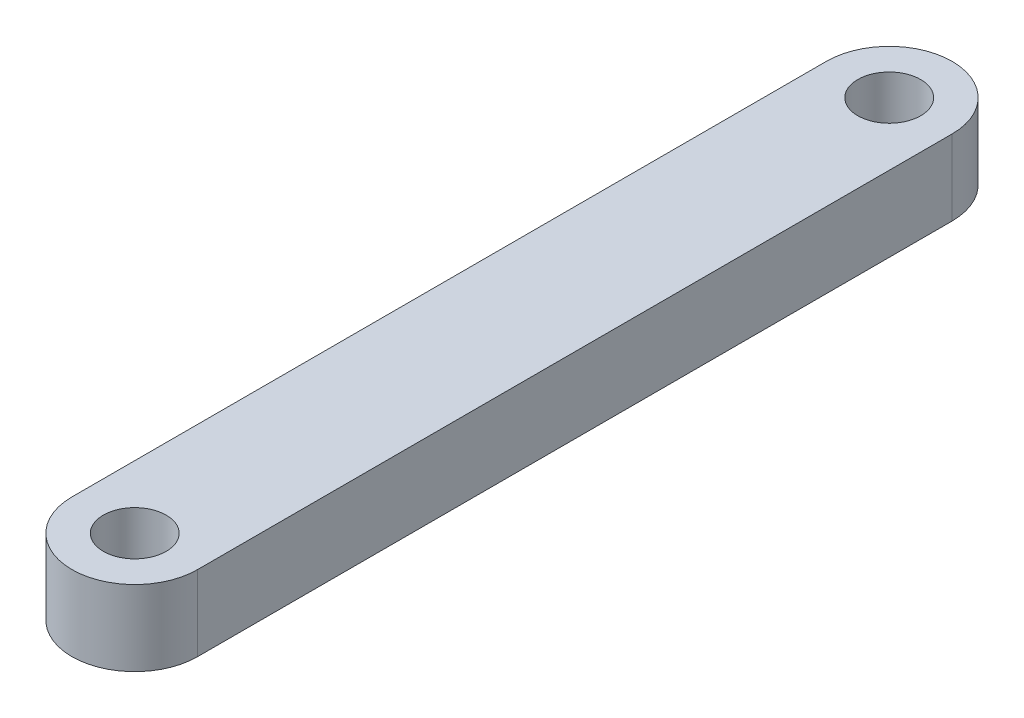
ISO-10303-21;
HEADER;
FILE_DESCRIPTION(('STEP AP214'),'2;1');
FILE_NAME('part.step','',(''),(''),'','','');
FILE_SCHEMA(('AUTOMOTIVE_DESIGN { 1 0 10303 214 1 1 1 1 }'));
ENDSEC;
DATA;
#1=APPLICATION_CONTEXT('core data for automotive mechanical design processes');
#2=APPLICATION_PROTOCOL_DEFINITION('international standard','automotive_design',2000,#1);
#3=PRODUCT_CONTEXT('',#1,'mechanical');
#4=PRODUCT('Part','Part','',(#3));
#5=PRODUCT_RELATED_PRODUCT_CATEGORY('part','',(#4));
#6=PRODUCT_DEFINITION_FORMATION('','',#4);
#7=PRODUCT_DEFINITION_CONTEXT('part definition',#1,'design');
#8=PRODUCT_DEFINITION('design','',#6,#7);
#9=PRODUCT_DEFINITION_SHAPE('','',#8);
#10=(LENGTH_UNIT() NAMED_UNIT(*) SI_UNIT(.MILLI.,.METRE.));
#11=(NAMED_UNIT(*) PLANE_ANGLE_UNIT() SI_UNIT($,.RADIAN.));
#12=(NAMED_UNIT(*) SI_UNIT($,.STERADIAN.) SOLID_ANGLE_UNIT());
#13=UNCERTAINTY_MEASURE_WITH_UNIT(LENGTH_MEASURE(1.E-05),#10,'distance_accuracy_value','');
#14=(GEOMETRIC_REPRESENTATION_CONTEXT(3) GLOBAL_UNCERTAINTY_ASSIGNED_CONTEXT((#13)) GLOBAL_UNIT_ASSIGNED_CONTEXT((#10,
#11,#12)) REPRESENTATION_CONTEXT('',''));
#15=CARTESIAN_POINT('',(0.,0.,0.));
#16=DIRECTION('',(0.,0.,1.));
#17=DIRECTION('',(1.,0.,0.));
#18=AXIS2_PLACEMENT_3D('',#15,#16,#17);
#19=CARTESIAN_POINT('',(-5.,-0.5,48.66232945296));
#20=DIRECTION('',(0.,1.,0.));
#21=DIRECTION('',(0.,0.,1.));
#22=AXIS2_PLACEMENT_3D('',#19,#20,#21);
#23=CYLINDRICAL_SURFACE('',#22,2.5);
#24=CARTESIAN_POINT('',(-5.,2.5,48.66232945296));
#25=DIRECTION('',(0.,1.,0.));
#26=DIRECTION('',(0.,0.,1.));
#27=AXIS2_PLACEMENT_3D('',#24,#25,#26);
#28=CIRCLE('',#27,2.5);
#29=CARTESIAN_POINT('',(-7.5,2.5,48.66232945296));
#30=VERTEX_POINT('',#29);
#31=CARTESIAN_POINT('',(-2.5,2.5,48.66232945296));
#32=VERTEX_POINT('',#31);
#33=EDGE_CURVE('E99',#30,#32,#28,.T.);
#34=ORIENTED_EDGE('',*,*,#33,.F.);
#35=DIRECTION('',(0.,1.,0.));
#36=VECTOR('',#35,1.);
#37=CARTESIAN_POINT('',(-7.5,-0.5,48.66232945296));
#38=LINE('',#37,#36);
#39=CARTESIAN_POINT('',(-7.5,-0.5,48.66232945296));
#40=VERTEX_POINT('',#39);
#41=EDGE_CURVE('E11',#40,#30,#38,.T.);
#42=ORIENTED_EDGE('',*,*,#41,.F.);
#43=CARTESIAN_POINT('',(-5.,-0.5,48.66232945296));
#44=DIRECTION('',(0.,1.,0.));
#45=DIRECTION('',(0.,0.,1.));
#46=AXIS2_PLACEMENT_3D('',#43,#44,#45);
#47=CIRCLE('',#46,2.5);
#48=CARTESIAN_POINT('',(-2.5,-0.5,48.66232945296));
#49=VERTEX_POINT('',#48);
#50=EDGE_CURVE('E92',#40,#49,#47,.T.);
#51=ORIENTED_EDGE('',*,*,#50,.T.);
#52=DIRECTION('',(0.,1.,0.));
#53=VECTOR('',#52,1.);
#54=CARTESIAN_POINT('',(-2.5,-0.5,48.66232945296));
#55=LINE('',#54,#53);
#56=EDGE_CURVE('E37',#49,#32,#55,.T.);
#57=ORIENTED_EDGE('',*,*,#56,.T.);
#58=EDGE_LOOP('',(#34,#42,#51,#57));
#59=FACE_BOUND('',#58,.T.);
#60=ADVANCED_FACE('F34',(#59),#23,.T.);
#61=CARTESIAN_POINT('',(-7.5,-0.5,18.66232945296));
#62=DIRECTION('',(-1.,0.,0.));
#63=DIRECTION('',(0.,0.,1.));
#64=AXIS2_PLACEMENT_3D('',#61,#62,#63);
#65=PLANE('',#64);
#66=DIRECTION('',(0.,0.,1.));
#67=VECTOR('',#66,1.);
#68=CARTESIAN_POINT('',(-7.5,2.5,18.66232945296));
#69=LINE('',#68,#67);
#70=CARTESIAN_POINT('',(-7.5,2.5,18.66232945296));
#71=VERTEX_POINT('',#70);
#72=EDGE_CURVE('E94',#71,#30,#69,.T.);
#73=ORIENTED_EDGE('',*,*,#72,.F.);
#74=DIRECTION('',(0.,1.,0.));
#75=VECTOR('',#74,1.);
#76=CARTESIAN_POINT('',(-7.5,-0.5,18.66232945296));
#77=LINE('',#76,#75);
#78=CARTESIAN_POINT('',(-7.5,-0.5,18.66232945296));
#79=VERTEX_POINT('',#78);
#80=EDGE_CURVE('E43',#79,#71,#77,.T.);
#81=ORIENTED_EDGE('',*,*,#80,.F.);
#82=DIRECTION('',(0.,0.,1.));
#83=VECTOR('',#82,1.);
#84=CARTESIAN_POINT('',(-7.5,-0.5,18.66232945296));
#85=LINE('',#84,#83);
#86=EDGE_CURVE('E89',#79,#40,#85,.T.);
#87=ORIENTED_EDGE('',*,*,#86,.T.);
#88=ORIENTED_EDGE('',*,*,#41,.T.);
#89=EDGE_LOOP('',(#73,#81,#87,#88));
#90=FACE_BOUND('',#89,.T.);
#91=ADVANCED_FACE('F110',(#90),#65,.T.);
#92=CARTESIAN_POINT('',(-5.,-0.5,18.66232945296));
#93=DIRECTION('',(0.,1.,0.));
#94=DIRECTION('',(0.,0.,1.));
#95=AXIS2_PLACEMENT_3D('',#92,#93,#94);
#96=CYLINDRICAL_SURFACE('',#95,2.5);
#97=CARTESIAN_POINT('',(-5.,2.5,18.66232945296));
#98=DIRECTION('',(0.,1.,0.));
#99=DIRECTION('',(0.,0.,1.));
#100=AXIS2_PLACEMENT_3D('',#97,#98,#99);
#101=CIRCLE('',#100,2.5);
#102=CARTESIAN_POINT('',(-2.5,2.5,18.66232945296));
#103=VERTEX_POINT('',#102);
#104=EDGE_CURVE('E84',#103,#71,#101,.T.);
#105=ORIENTED_EDGE('',*,*,#104,.F.);
#106=DIRECTION('',(0.,1.,0.));
#107=VECTOR('',#106,1.);
#108=CARTESIAN_POINT('',(-2.5,-0.5,18.66232945296));
#109=LINE('',#108,#107);
#110=CARTESIAN_POINT('',(-2.5,-0.5,18.66232945296));
#111=VERTEX_POINT('',#110);
#112=EDGE_CURVE('E79',#111,#103,#109,.T.);
#113=ORIENTED_EDGE('',*,*,#112,.F.);
#114=CARTESIAN_POINT('',(-5.,-0.5,18.66232945296));
#115=DIRECTION('',(0.,1.,0.));
#116=DIRECTION('',(0.,0.,1.));
#117=AXIS2_PLACEMENT_3D('',#114,#115,#116);
#118=CIRCLE('',#117,2.5);
#119=EDGE_CURVE('E82',#111,#79,#118,.T.);
#120=ORIENTED_EDGE('',*,*,#119,.T.);
#121=ORIENTED_EDGE('',*,*,#80,.T.);
#122=EDGE_LOOP('',(#105,#113,#120,#121));
#123=FACE_BOUND('',#122,.T.);
#124=ADVANCED_FACE('F81',(#123),#96,.T.);
#125=CARTESIAN_POINT('',(-2.5,-0.5,48.66232945296));
#126=DIRECTION('',(1.,0.,0.));
#127=DIRECTION('',(0.,0.,-1.));
#128=AXIS2_PLACEMENT_3D('',#125,#126,#127);
#129=PLANE('',#128);
#130=DIRECTION('',(0.,0.,-1.));
#131=VECTOR('',#130,1.);
#132=CARTESIAN_POINT('',(-2.5,2.5,48.66232945296));
#133=LINE('',#132,#131);
#134=EDGE_CURVE('E102',#32,#103,#133,.T.);
#135=ORIENTED_EDGE('',*,*,#134,.F.);
#136=ORIENTED_EDGE('',*,*,#56,.F.);
#137=DIRECTION('',(0.,0.,-1.));
#138=VECTOR('',#137,1.);
#139=CARTESIAN_POINT('',(-2.5,-0.5,48.66232945296));
#140=LINE('',#139,#138);
#141=EDGE_CURVE('E88',#49,#111,#140,.T.);
#142=ORIENTED_EDGE('',*,*,#141,.T.);
#143=ORIENTED_EDGE('',*,*,#112,.T.);
#144=EDGE_LOOP('',(#135,#136,#142,#143));
#145=FACE_BOUND('',#144,.T.);
#146=ADVANCED_FACE('F91',(#145),#129,.T.);
#147=CARTESIAN_POINT('',(-5.,-0.5,48.66232945296));
#148=DIRECTION('',(0.,1.,0.));
#149=DIRECTION('',(0.,0.,1.));
#150=AXIS2_PLACEMENT_3D('',#147,#148,#149);
#151=PLANE('',#150);
#152=CARTESIAN_POINT('',(-5.,-0.5,48.66232945296));
#153=DIRECTION('',(0.,-1.,0.));
#154=DIRECTION('',(0.,0.,-1.));
#155=AXIS2_PLACEMENT_3D('',#152,#153,#154);
#156=CIRCLE('',#155,1.25);
#157=CARTESIAN_POINT('',(-5.,-0.5,47.41232945296));
#158=VERTEX_POINT('',#157);
#159=EDGE_CURVE('E146',#158,#158,#156,.T.);
#160=ORIENTED_EDGE('',*,*,#159,.F.);
#161=EDGE_LOOP('',(#160));
#162=FACE_BOUND('',#161,.T.);
#163=CARTESIAN_POINT('',(-5.,-0.5,18.66232945296));
#164=DIRECTION('',(0.,-1.,0.));
#165=DIRECTION('',(0.,0.,-1.));
#166=AXIS2_PLACEMENT_3D('',#163,#164,#165);
#167=CIRCLE('',#166,1.25);
#168=CARTESIAN_POINT('',(-5.,-0.5,17.41232945296));
#169=VERTEX_POINT('',#168);
#170=EDGE_CURVE('E148',#169,#169,#167,.T.);
#171=ORIENTED_EDGE('',*,*,#170,.F.);
#172=EDGE_LOOP('',(#171));
#173=FACE_BOUND('',#172,.T.);
#174=ORIENTED_EDGE('',*,*,#50,.F.);
#175=ORIENTED_EDGE('',*,*,#86,.F.);
#176=ORIENTED_EDGE('',*,*,#119,.F.);
#177=ORIENTED_EDGE('',*,*,#141,.F.);
#178=EDGE_LOOP('',(#174,#175,#176,#177));
#179=FACE_BOUND('',#178,.T.);
#180=ADVANCED_FACE('F87',(#162,#173,#179),#151,.F.);
#181=CARTESIAN_POINT('',(-5.,2.5,48.66232945296));
#182=DIRECTION('',(0.,1.,0.));
#183=DIRECTION('',(0.,0.,1.));
#184=AXIS2_PLACEMENT_3D('',#181,#182,#183);
#185=PLANE('',#184);
#186=CARTESIAN_POINT('',(-5.,2.5,48.66232945296));
#187=DIRECTION('',(0.,-1.,0.));
#188=DIRECTION('',(0.,0.,-1.));
#189=AXIS2_PLACEMENT_3D('',#186,#187,#188);
#190=CIRCLE('',#189,1.25);
#191=CARTESIAN_POINT('',(-5.,2.5,47.41232945296));
#192=VERTEX_POINT('',#191);
#193=EDGE_CURVE('E144',#192,#192,#190,.T.);
#194=ORIENTED_EDGE('',*,*,#193,.T.);
#195=EDGE_LOOP('',(#194));
#196=FACE_BOUND('',#195,.T.);
#197=CARTESIAN_POINT('',(-5.,2.5,18.66232945296));
#198=DIRECTION('',(0.,-1.,0.));
#199=DIRECTION('',(0.,0.,-1.));
#200=AXIS2_PLACEMENT_3D('',#197,#198,#199);
#201=CIRCLE('',#200,1.25);
#202=CARTESIAN_POINT('',(-5.,2.5,17.41232945296));
#203=VERTEX_POINT('',#202);
#204=EDGE_CURVE('E103',#203,#203,#201,.T.);
#205=ORIENTED_EDGE('',*,*,#204,.T.);
#206=EDGE_LOOP('',(#205));
#207=FACE_BOUND('',#206,.T.);
#208=ORIENTED_EDGE('',*,*,#33,.T.);
#209=ORIENTED_EDGE('',*,*,#134,.T.);
#210=ORIENTED_EDGE('',*,*,#104,.T.);
#211=ORIENTED_EDGE('',*,*,#72,.T.);
#212=EDGE_LOOP('',(#208,#209,#210,#211));
#213=FACE_BOUND('',#212,.T.);
#214=ADVANCED_FACE('F109',(#196,#207,#213),#185,.T.);
#215=CARTESIAN_POINT('',(-5.,2.5,18.66232945296));
#216=DIRECTION('',(0.,-1.,0.));
#217=DIRECTION('',(0.,0.,-1.));
#218=AXIS2_PLACEMENT_3D('',#215,#216,#217);
#219=CYLINDRICAL_SURFACE('',#218,1.25);
#220=ORIENTED_EDGE('',*,*,#204,.F.);
#221=EDGE_LOOP('',(#220));
#222=FACE_BOUND('',#221,.T.);
#223=ORIENTED_EDGE('',*,*,#170,.T.);
#224=EDGE_LOOP('',(#223));
#225=FACE_BOUND('',#224,.T.);
#226=ADVANCED_FACE('F128',(#222,#225),#219,.F.);
#227=CARTESIAN_POINT('',(-5.,2.5,48.66232945296));
#228=DIRECTION('',(0.,-1.,0.));
#229=DIRECTION('',(0.,0.,-1.));
#230=AXIS2_PLACEMENT_3D('',#227,#228,#229);
#231=CYLINDRICAL_SURFACE('',#230,1.25);
#232=ORIENTED_EDGE('',*,*,#193,.F.);
#233=EDGE_LOOP('',(#232));
#234=FACE_BOUND('',#233,.T.);
#235=ORIENTED_EDGE('',*,*,#159,.T.);
#236=EDGE_LOOP('',(#235));
#237=FACE_BOUND('',#236,.T.);
#238=ADVANCED_FACE('F135',(#234,#237),#231,.F.);
#239=CLOSED_SHELL('',(#60,#91,#124,#146,#180,#214,#226,#238));
#240=MANIFOLD_SOLID_BREP('B2',#239);
#241=ADVANCED_BREP_SHAPE_REPRESENTATION('',(#18,#240),#14);
#242=SHAPE_DEFINITION_REPRESENTATION(#9,#241);
ENDSEC;
END-ISO-10303-21;
